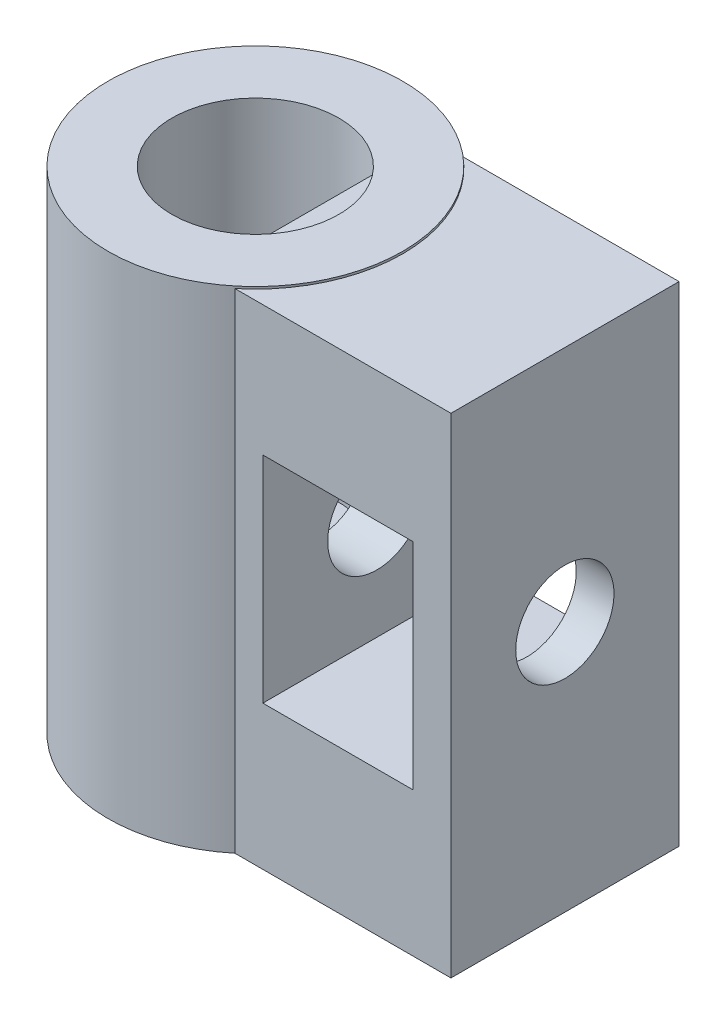
ISO-10303-21;
HEADER;
FILE_DESCRIPTION(('STEP AP214'),'2;1');
FILE_NAME('part.step','',(''),(''),'','','');
FILE_SCHEMA(('AUTOMOTIVE_DESIGN { 1 0 10303 214 1 1 1 1 }'));
ENDSEC;
DATA;
#1=APPLICATION_CONTEXT('core data for automotive mechanical design processes');
#2=APPLICATION_PROTOCOL_DEFINITION('international standard','automotive_design',2000,#1);
#3=PRODUCT_CONTEXT('',#1,'mechanical');
#4=PRODUCT('Part','Part','',(#3));
#5=PRODUCT_RELATED_PRODUCT_CATEGORY('part','',(#4));
#6=PRODUCT_DEFINITION_FORMATION('','',#4);
#7=PRODUCT_DEFINITION_CONTEXT('part definition',#1,'design');
#8=PRODUCT_DEFINITION('design','',#6,#7);
#9=PRODUCT_DEFINITION_SHAPE('','',#8);
#10=(LENGTH_UNIT() NAMED_UNIT(*) SI_UNIT(.MILLI.,.METRE.));
#11=(NAMED_UNIT(*) PLANE_ANGLE_UNIT() SI_UNIT($,.RADIAN.));
#12=(NAMED_UNIT(*) SI_UNIT($,.STERADIAN.) SOLID_ANGLE_UNIT());
#13=UNCERTAINTY_MEASURE_WITH_UNIT(LENGTH_MEASURE(1.E-05),#10,'distance_accuracy_value','');
#14=(GEOMETRIC_REPRESENTATION_CONTEXT(3) GLOBAL_UNCERTAINTY_ASSIGNED_CONTEXT((#13)) GLOBAL_UNIT_ASSIGNED_CONTEXT((#10,
#11,#12)) REPRESENTATION_CONTEXT('',''));
#15=CARTESIAN_POINT('',(0.,0.,0.));
#16=DIRECTION('',(0.,0.,1.));
#17=DIRECTION('',(1.,0.,0.));
#18=AXIS2_PLACEMENT_3D('',#15,#16,#17);
#19=CARTESIAN_POINT('',(12.6,19.9099600410235,-4.64846917483186));
#20=DIRECTION('',(0.,0.,-1.));
#21=DIRECTION('',(-1.,0.,0.));
#22=AXIS2_PLACEMENT_3D('',#19,#20,#21);
#23=PLANE('',#22);
#24=DIRECTION('',(0.,-1.,0.));
#25=VECTOR('',#24,1.);
#26=CARTESIAN_POINT('',(3.79364393830497,20.,-4.64846917483186));
#27=LINE('',#26,#25);
#28=CARTESIAN_POINT('',(3.79364393830497,19.9099600410235,-4.64846917483186));
#29=VERTEX_POINT('',#28);
#30=CARTESIAN_POINT('',(3.79364393830497,0.,-4.64846917483186));
#31=VERTEX_POINT('',#30);
#32=EDGE_CURVE('E170',#29,#31,#27,.T.);
#33=ORIENTED_EDGE('',*,*,#32,.F.);
#34=DIRECTION('',(-1.,0.,0.));
#35=VECTOR('',#34,1.);
#36=CARTESIAN_POINT('',(12.6,19.9099600410235,-4.64846917483186));
#37=LINE('',#36,#35);
#38=CARTESIAN_POINT('',(12.6,19.9099600410235,-4.64846917483186));
#39=VERTEX_POINT('',#38);
#40=EDGE_CURVE('E155',#39,#29,#37,.T.);
#41=ORIENTED_EDGE('',*,*,#40,.F.);
#42=DIRECTION('',(0.,-1.,0.));
#43=VECTOR('',#42,1.);
#44=CARTESIAN_POINT('',(12.6,19.9099600410235,-4.64846917483186));
#45=LINE('',#44,#43);
#46=CARTESIAN_POINT('',(12.6,0.,-4.64846917483186));
#47=VERTEX_POINT('',#46);
#48=EDGE_CURVE('E140',#39,#47,#45,.T.);
#49=ORIENTED_EDGE('',*,*,#48,.T.);
#50=DIRECTION('',(-1.,0.,0.));
#51=VECTOR('',#50,1.);
#52=CARTESIAN_POINT('',(12.6,0.,-4.64846917483186));
#53=LINE('',#52,#51);
#54=EDGE_CURVE('E152',#47,#31,#53,.T.);
#55=ORIENTED_EDGE('',*,*,#54,.T.);
#56=EDGE_LOOP('',(#33,#41,#49,#55));
#57=FACE_BOUND('',#56,.T.);
#58=DIRECTION('',(0.,1.,0.));
#59=VECTOR('',#58,1.);
#60=CARTESIAN_POINT('',(11.0634302269429,19.9099600410235,-4.64846917483186));
#61=LINE('',#60,#59);
#62=CARTESIAN_POINT('',(11.0634302269429,5.86192553685862,-4.64846917483186));
#63=VERTEX_POINT('',#62);
#64=CARTESIAN_POINT('',(11.0634302269429,14.6119255368586,-4.64846917483186));
#65=VERTEX_POINT('',#64);
#66=EDGE_CURVE('E109',#63,#65,#61,.T.);
#67=ORIENTED_EDGE('',*,*,#66,.T.);
#68=DIRECTION('',(-1.,0.,0.));
#69=VECTOR('',#68,1.);
#70=CARTESIAN_POINT('',(12.6,14.6119255368586,-4.64846917483186));
#71=LINE('',#70,#69);
#72=CARTESIAN_POINT('',(4.94343022694287,14.6119255368586,-4.64846917483186));
#73=VERTEX_POINT('',#72);
#74=EDGE_CURVE('E128',#65,#73,#71,.T.);
#75=ORIENTED_EDGE('',*,*,#74,.T.);
#76=DIRECTION('',(0.,-1.,0.));
#77=VECTOR('',#76,1.);
#78=CARTESIAN_POINT('',(4.94343022694287,19.9099600410235,-4.64846917483186));
#79=LINE('',#78,#77);
#80=CARTESIAN_POINT('',(4.94343022694287,5.86192553685862,-4.64846917483186));
#81=VERTEX_POINT('',#80);
#82=EDGE_CURVE('E127',#73,#81,#79,.T.);
#83=ORIENTED_EDGE('',*,*,#82,.T.);
#84=DIRECTION('',(1.,0.,0.));
#85=VECTOR('',#84,1.);
#86=CARTESIAN_POINT('',(12.6,5.86192553685862,-4.64846917483186));
#87=LINE('',#86,#85);
#88=EDGE_CURVE('E120',#81,#63,#87,.T.);
#89=ORIENTED_EDGE('',*,*,#88,.T.);
#90=EDGE_LOOP('',(#67,#75,#83,#89));
#91=FACE_BOUND('',#90,.T.);
#92=ADVANCED_FACE('F35',(#57,#91),#23,.T.);
#93=CARTESIAN_POINT('',(12.6,19.9099600410235,4.63803278086594));
#94=DIRECTION('',(0.,0.,1.));
#95=DIRECTION('',(0.,-1.,0.));
#96=AXIS2_PLACEMENT_3D('',#93,#94,#95);
#97=PLANE('',#96);
#98=DIRECTION('',(0.,-1.,0.));
#99=VECTOR('',#98,1.);
#100=CARTESIAN_POINT('',(3.80639618584468,20.,4.63803278086594));
#101=LINE('',#100,#99);
#102=CARTESIAN_POINT('',(3.80639618584468,0.,4.63803278086594));
#103=VERTEX_POINT('',#102);
#104=CARTESIAN_POINT('',(3.80639618584468,19.9099600410235,4.63803278086594));
#105=VERTEX_POINT('',#104);
#106=EDGE_CURVE('E168',#103,#105,#101,.F.);
#107=ORIENTED_EDGE('',*,*,#106,.F.);
#108=DIRECTION('',(-1.,0.,0.));
#109=VECTOR('',#108,1.);
#110=CARTESIAN_POINT('',(12.6,0.,4.63803278086594));
#111=LINE('',#110,#109);
#112=CARTESIAN_POINT('',(12.6,0.,4.63803278086594));
#113=VERTEX_POINT('',#112);
#114=EDGE_CURVE('E162',#113,#103,#111,.T.);
#115=ORIENTED_EDGE('',*,*,#114,.F.);
#116=DIRECTION('',(0.,1.,0.));
#117=VECTOR('',#116,1.);
#118=CARTESIAN_POINT('',(12.6,19.9099600410235,4.63803278086594));
#119=LINE('',#118,#117);
#120=CARTESIAN_POINT('',(12.6,19.9099600410235,4.63803278086594));
#121=VERTEX_POINT('',#120);
#122=EDGE_CURVE('E146',#113,#121,#119,.T.);
#123=ORIENTED_EDGE('',*,*,#122,.T.);
#124=DIRECTION('',(-1.,0.,0.));
#125=VECTOR('',#124,1.);
#126=CARTESIAN_POINT('',(12.6,19.9099600410235,4.63803278086594));
#127=LINE('',#126,#125);
#128=EDGE_CURVE('E159',#121,#105,#127,.T.);
#129=ORIENTED_EDGE('',*,*,#128,.T.);
#130=EDGE_LOOP('',(#107,#115,#123,#129));
#131=FACE_BOUND('',#130,.T.);
#132=DIRECTION('',(0.,1.,0.));
#133=VECTOR('',#132,1.);
#134=CARTESIAN_POINT('',(4.94343022694287,19.9099600410235,4.63803278086594));
#135=LINE('',#134,#133);
#136=CARTESIAN_POINT('',(4.94343022694287,5.86192553685862,4.63803278086594));
#137=VERTEX_POINT('',#136);
#138=CARTESIAN_POINT('',(4.94343022694287,14.6119255368586,4.63803278086594));
#139=VERTEX_POINT('',#138);
#140=EDGE_CURVE('E132',#137,#139,#135,.T.);
#141=ORIENTED_EDGE('',*,*,#140,.T.);
#142=DIRECTION('',(1.,0.,0.));
#143=VECTOR('',#142,1.);
#144=CARTESIAN_POINT('',(12.6,14.6119255368586,4.63803278086594));
#145=LINE('',#144,#143);
#146=CARTESIAN_POINT('',(11.0634302269429,14.6119255368586,4.63803278086594));
#147=VERTEX_POINT('',#146);
#148=EDGE_CURVE('E11',#139,#147,#145,.T.);
#149=ORIENTED_EDGE('',*,*,#148,.T.);
#150=DIRECTION('',(0.,-1.,0.));
#151=VECTOR('',#150,1.);
#152=CARTESIAN_POINT('',(11.0634302269429,19.9099600410235,4.63803278086594));
#153=LINE('',#152,#151);
#154=CARTESIAN_POINT('',(11.0634302269429,5.86192553685862,4.63803278086594));
#155=VERTEX_POINT('',#154);
#156=EDGE_CURVE('E115',#147,#155,#153,.T.);
#157=ORIENTED_EDGE('',*,*,#156,.T.);
#158=DIRECTION('',(-1.,0.,0.));
#159=VECTOR('',#158,1.);
#160=CARTESIAN_POINT('',(12.6,5.86192553685862,4.63803278086594));
#161=LINE('',#160,#159);
#162=EDGE_CURVE('E43',#155,#137,#161,.T.);
#163=ORIENTED_EDGE('',*,*,#162,.T.);
#164=EDGE_LOOP('',(#141,#149,#157,#163));
#165=FACE_BOUND('',#164,.T.);
#166=ADVANCED_FACE('F202',(#131,#165),#97,.T.);
#167=CARTESIAN_POINT('',(1.6,10.2369255368586,0.));
#168=DIRECTION('',(1.,0.,0.));
#169=DIRECTION('',(0.,0.,-1.));
#170=AXIS2_PLACEMENT_3D('',#167,#168,#169);
#171=CYLINDRICAL_SURFACE('',#170,2.);
#172=CARTESIAN_POINT('',(2.6,10.2369255368586,0.));
#173=DIRECTION('',(-1.,0.,0.));
#174=DIRECTION('',(0.,0.,1.));
#175=AXIS2_PLACEMENT_3D('',#172,#173,#174);
#176=CIRCLE('',#175,2.);
#177=CARTESIAN_POINT('',(2.6,10.2369255368586,2.));
#178=VERTEX_POINT('',#177);
#179=EDGE_CURVE('E136',#178,#178,#176,.F.);
#180=ORIENTED_EDGE('',*,*,#179,.F.);
#181=EDGE_LOOP('',(#180));
#182=FACE_BOUND('',#181,.T.);
#183=CARTESIAN_POINT('',(4.94343022694287,10.2369255368586,0.));
#184=DIRECTION('',(1.,0.,0.));
#185=DIRECTION('',(0.,0.,-1.));
#186=AXIS2_PLACEMENT_3D('',#183,#184,#185);
#187=CIRCLE('',#186,2.);
#188=CARTESIAN_POINT('',(4.94343022694287,10.2369255368586,-2.));
#189=VERTEX_POINT('',#188);
#190=EDGE_CURVE('E114',#189,#189,#187,.T.);
#191=ORIENTED_EDGE('',*,*,#190,.T.);
#192=EDGE_LOOP('',(#191));
#193=FACE_BOUND('',#192,.T.);
#194=ADVANCED_FACE('F233',(#182,#193),#171,.F.);
#195=CARTESIAN_POINT('',(12.6,10.2369255368586,0.));
#196=DIRECTION('',(-1.,0.,0.));
#197=DIRECTION('',(0.,0.,1.));
#198=AXIS2_PLACEMENT_3D('',#195,#196,#197);
#199=CIRCLE('',#198,2.);
#200=CARTESIAN_POINT('',(12.6,10.2369255368586,2.));
#201=VERTEX_POINT('',#200);
#202=EDGE_CURVE('E130',#201,#201,#199,.F.);
#203=ORIENTED_EDGE('',*,*,#202,.T.);
#204=EDGE_LOOP('',(#203));
#205=FACE_BOUND('',#204,.T.);
#206=CARTESIAN_POINT('',(11.0634302269429,10.2369255368586,0.));
#207=DIRECTION('',(-1.,0.,0.));
#208=DIRECTION('',(0.,0.,1.));
#209=AXIS2_PLACEMENT_3D('',#206,#207,#208);
#210=CIRCLE('',#209,2.);
#211=CARTESIAN_POINT('',(11.0634302269429,10.2369255368586,2.));
#212=VERTEX_POINT('',#211);
#213=EDGE_CURVE('E196',#212,#212,#210,.T.);
#214=ORIENTED_EDGE('',*,*,#213,.T.);
#215=EDGE_LOOP('',(#214));
#216=FACE_BOUND('',#215,.T.);
#217=ADVANCED_FACE('F275',(#205,#216),#171,.F.);
#218=CARTESIAN_POINT('',(0.,20.,0.));
#219=DIRECTION('',(0.,-1.,0.));
#220=DIRECTION('',(0.,0.,-1.));
#221=AXIS2_PLACEMENT_3D('',#218,#219,#220);
#222=CYLINDRICAL_SURFACE('',#221,6.);
#223=CARTESIAN_POINT('',(0.,20.,0.));
#224=DIRECTION('',(0.,1.,0.));
#225=DIRECTION('',(0.,0.,1.));
#226=AXIS2_PLACEMENT_3D('',#223,#224,#225);
#227=CIRCLE('',#226,6.);
#228=CARTESIAN_POINT('',(0.,20.,6.));
#229=VERTEX_POINT('',#228);
#230=EDGE_CURVE('E184',#229,#229,#227,.T.);
#231=ORIENTED_EDGE('',*,*,#230,.F.);
#232=EDGE_LOOP('',(#231));
#233=FACE_BOUND('',#232,.T.);
#234=CARTESIAN_POINT('',(0.,19.9099600410235,0.));
#235=DIRECTION('',(0.,1.,0.));
#236=DIRECTION('',(0.,0.,1.));
#237=AXIS2_PLACEMENT_3D('',#234,#235,#236);
#238=CIRCLE('',#237,6.);
#239=EDGE_CURVE('E158',#105,#29,#238,.T.);
#240=ORIENTED_EDGE('',*,*,#239,.T.);
#241=ORIENTED_EDGE('',*,*,#32,.T.);
#242=CARTESIAN_POINT('',(0.,0.,0.));
#243=DIRECTION('',(0.,1.,0.));
#244=DIRECTION('',(0.,0.,1.));
#245=AXIS2_PLACEMENT_3D('',#242,#243,#244);
#246=CIRCLE('',#245,6.);
#247=EDGE_CURVE('E181',#31,#103,#246,.T.);
#248=ORIENTED_EDGE('',*,*,#247,.T.);
#249=ORIENTED_EDGE('',*,*,#106,.T.);
#250=EDGE_LOOP('',(#240,#241,#248,#249));
#251=FACE_BOUND('',#250,.T.);
#252=ADVANCED_FACE('F37',(#233,#251),#222,.T.);
#253=CARTESIAN_POINT('',(0.,20.,0.));
#254=DIRECTION('',(0.,1.,0.));
#255=DIRECTION('',(0.,0.,1.));
#256=AXIS2_PLACEMENT_3D('',#253,#254,#255);
#257=PLANE('',#256);
#258=CARTESIAN_POINT('',(0.,20.,0.));
#259=DIRECTION('',(0.,1.,0.));
#260=DIRECTION('',(0.,0.,1.));
#261=AXIS2_PLACEMENT_3D('',#258,#259,#260);
#262=CIRCLE('',#261,3.4);
#263=CARTESIAN_POINT('',(0.,20.,3.4));
#264=VERTEX_POINT('',#263);
#265=EDGE_CURVE('E178',#264,#264,#262,.T.);
#266=ORIENTED_EDGE('',*,*,#265,.F.);
#267=EDGE_LOOP('',(#266));
#268=FACE_BOUND('',#267,.T.);
#269=ORIENTED_EDGE('',*,*,#230,.T.);
#270=EDGE_LOOP('',(#269));
#271=FACE_BOUND('',#270,.T.);
#272=ADVANCED_FACE('F253',(#268,#271),#257,.T.);
#273=CARTESIAN_POINT('',(0.,0.,0.));
#274=DIRECTION('',(0.,1.,0.));
#275=DIRECTION('',(0.,0.,1.));
#276=AXIS2_PLACEMENT_3D('',#273,#274,#275);
#277=PLANE('',#276);
#278=ORIENTED_EDGE('',*,*,#247,.F.);
#279=ORIENTED_EDGE('',*,*,#54,.F.);
#280=DIRECTION('',(0.,0.,1.));
#281=VECTOR('',#280,1.);
#282=CARTESIAN_POINT('',(12.6,0.,-4.64846917483186));
#283=LINE('',#282,#281);
#284=EDGE_CURVE('E143',#47,#113,#283,.T.);
#285=ORIENTED_EDGE('',*,*,#284,.T.);
#286=ORIENTED_EDGE('',*,*,#114,.T.);
#287=EDGE_LOOP('',(#278,#279,#285,#286));
#288=FACE_BOUND('',#287,.T.);
#289=ADVANCED_FACE('F251',(#288),#277,.F.);
#290=CARTESIAN_POINT('',(0.,6.45,0.));
#291=DIRECTION('',(0.,1.,0.));
#292=DIRECTION('',(0.,0.,1.));
#293=AXIS2_PLACEMENT_3D('',#290,#291,#292);
#294=CYLINDRICAL_SURFACE('',#293,3.4);
#295=CARTESIAN_POINT('',(0.,19.9099600410235,0.));
#296=DIRECTION('',(0.,1.,0.));
#297=DIRECTION('',(0.,0.,1.));
#298=AXIS2_PLACEMENT_3D('',#295,#296,#297);
#299=CIRCLE('',#298,3.4);
#300=CARTESIAN_POINT('',(2.6,19.9099600410235,-2.19089023002066));
#301=VERTEX_POINT('',#300);
#302=CARTESIAN_POINT('',(2.6,19.9099600410235,2.19089023002066));
#303=VERTEX_POINT('',#302);
#304=EDGE_CURVE('E191',#301,#303,#299,.F.);
#305=ORIENTED_EDGE('',*,*,#304,.T.);
#306=DIRECTION('',(0.,1.,0.));
#307=VECTOR('',#306,1.);
#308=CARTESIAN_POINT('',(2.6,6.45,2.19089023002067));
#309=LINE('',#308,#307);
#310=CARTESIAN_POINT('',(2.6,6.45,2.19089023002066));
#311=VERTEX_POINT('',#310);
#312=EDGE_CURVE('E175',#303,#311,#309,.F.);
#313=ORIENTED_EDGE('',*,*,#312,.T.);
#314=CARTESIAN_POINT('',(0.,6.45,0.));
#315=DIRECTION('',(0.,1.,0.));
#316=DIRECTION('',(0.,0.,1.));
#317=AXIS2_PLACEMENT_3D('',#314,#315,#316);
#318=CIRCLE('',#317,3.4);
#319=CARTESIAN_POINT('',(2.6,6.45,-2.19089023002066));
#320=VERTEX_POINT('',#319);
#321=EDGE_CURVE('E179',#320,#311,#318,.T.);
#322=ORIENTED_EDGE('',*,*,#321,.F.);
#323=DIRECTION('',(0.,1.,0.));
#324=VECTOR('',#323,1.);
#325=CARTESIAN_POINT('',(2.6,6.45,-2.19089023002067));
#326=LINE('',#325,#324);
#327=EDGE_CURVE('E173',#320,#301,#326,.T.);
#328=ORIENTED_EDGE('',*,*,#327,.T.);
#329=EDGE_LOOP('',(#305,#313,#322,#328));
#330=FACE_BOUND('',#329,.T.);
#331=ORIENTED_EDGE('',*,*,#265,.T.);
#332=EDGE_LOOP('',(#331));
#333=FACE_BOUND('',#332,.T.);
#334=ADVANCED_FACE('F247',(#330,#333),#294,.F.);
#335=CARTESIAN_POINT('',(0.,6.45,0.));
#336=DIRECTION('',(0.,1.,0.));
#337=DIRECTION('',(0.,0.,1.));
#338=AXIS2_PLACEMENT_3D('',#335,#336,#337);
#339=PLANE('',#338);
#340=DIRECTION('',(0.,0.,1.));
#341=VECTOR('',#340,1.);
#342=CARTESIAN_POINT('',(2.6,6.45,0.));
#343=LINE('',#342,#341);
#344=EDGE_CURVE('E187',#320,#311,#343,.T.);
#345=ORIENTED_EDGE('',*,*,#344,.F.);
#346=ORIENTED_EDGE('',*,*,#321,.T.);
#347=EDGE_LOOP('',(#345,#346));
#348=FACE_BOUND('',#347,.T.);
#349=ADVANCED_FACE('F243',(#348),#339,.T.);
#350=CARTESIAN_POINT('',(2.6,4.71,3.57158819939229));
#351=DIRECTION('',(-1.,0.,0.));
#352=DIRECTION('',(0.,0.,1.));
#353=AXIS2_PLACEMENT_3D('',#350,#351,#352);
#354=PLANE('',#353);
#355=ORIENTED_EDGE('',*,*,#179,.T.);
#356=EDGE_LOOP('',(#355));
#357=FACE_BOUND('',#356,.T.);
#358=ORIENTED_EDGE('',*,*,#312,.F.);
#359=DIRECTION('',(0.,0.,-1.));
#360=VECTOR('',#359,1.);
#361=CARTESIAN_POINT('',(2.6,19.9099600410235,-4.64846917483186));
#362=LINE('',#361,#360);
#363=EDGE_CURVE('E139',#303,#301,#362,.T.);
#364=ORIENTED_EDGE('',*,*,#363,.T.);
#365=ORIENTED_EDGE('',*,*,#327,.F.);
#366=ORIENTED_EDGE('',*,*,#344,.T.);
#367=EDGE_LOOP('',(#358,#364,#365,#366));
#368=FACE_BOUND('',#367,.T.);
#369=ADVANCED_FACE('F239',(#357,#368),#354,.T.);
#370=CARTESIAN_POINT('',(12.6,19.9099600410235,-4.64846917483186));
#371=DIRECTION('',(0.,1.,0.));
#372=DIRECTION('',(0.,0.,1.));
#373=AXIS2_PLACEMENT_3D('',#370,#371,#372);
#374=PLANE('',#373);
#375=ORIENTED_EDGE('',*,*,#304,.F.);
#376=ORIENTED_EDGE('',*,*,#363,.F.);
#377=EDGE_LOOP('',(#375,#376));
#378=FACE_BOUND('',#377,.T.);
#379=ADVANCED_FACE('F242',(#378),#374,.T.);
#380=ORIENTED_EDGE('',*,*,#239,.F.);
#381=ORIENTED_EDGE('',*,*,#128,.F.);
#382=DIRECTION('',(0.,0.,-1.));
#383=VECTOR('',#382,1.);
#384=CARTESIAN_POINT('',(12.6,19.9099600410235,-4.64846917483186));
#385=LINE('',#384,#383);
#386=EDGE_CURVE('E149',#121,#39,#385,.T.);
#387=ORIENTED_EDGE('',*,*,#386,.T.);
#388=ORIENTED_EDGE('',*,*,#40,.T.);
#389=EDGE_LOOP('',(#380,#381,#387,#388));
#390=FACE_BOUND('',#389,.T.);
#391=ADVANCED_FACE('F223',(#390),#374,.T.);
#392=CARTESIAN_POINT('',(12.6,0.,0.));
#393=DIRECTION('',(-1.,0.,0.));
#394=DIRECTION('',(0.,0.,1.));
#395=AXIS2_PLACEMENT_3D('',#392,#393,#394);
#396=PLANE('',#395);
#397=ORIENTED_EDGE('',*,*,#202,.F.);
#398=EDGE_LOOP('',(#397));
#399=FACE_BOUND('',#398,.T.);
#400=ORIENTED_EDGE('',*,*,#48,.F.);
#401=ORIENTED_EDGE('',*,*,#386,.F.);
#402=ORIENTED_EDGE('',*,*,#122,.F.);
#403=ORIENTED_EDGE('',*,*,#284,.F.);
#404=EDGE_LOOP('',(#400,#401,#402,#403));
#405=FACE_BOUND('',#404,.T.);
#406=ADVANCED_FACE('F215',(#399,#405),#396,.F.);
#407=CARTESIAN_POINT('',(4.94343022694287,14.6119255368586,10.));
#408=DIRECTION('',(0.,-1.,0.));
#409=DIRECTION('',(0.,0.,-1.));
#410=AXIS2_PLACEMENT_3D('',#407,#408,#409);
#411=PLANE('',#410);
#412=DIRECTION('',(0.,0.,-1.));
#413=VECTOR('',#412,1.);
#414=CARTESIAN_POINT('',(11.0634302269429,14.6119255368586,10.));
#415=LINE('',#414,#413);
#416=EDGE_CURVE('E50',#147,#65,#415,.T.);
#417=ORIENTED_EDGE('',*,*,#416,.F.);
#418=ORIENTED_EDGE('',*,*,#148,.F.);
#419=DIRECTION('',(0.,0.,-1.));
#420=VECTOR('',#419,1.);
#421=CARTESIAN_POINT('',(4.94343022694287,14.6119255368586,10.));
#422=LINE('',#421,#420);
#423=EDGE_CURVE('E206',#139,#73,#422,.T.);
#424=ORIENTED_EDGE('',*,*,#423,.T.);
#425=ORIENTED_EDGE('',*,*,#74,.F.);
#426=EDGE_LOOP('',(#417,#418,#424,#425));
#427=FACE_BOUND('',#426,.T.);
#428=ADVANCED_FACE('F213',(#427),#411,.T.);
#429=CARTESIAN_POINT('',(4.94343022694287,5.86192553685862,10.));
#430=DIRECTION('',(1.,0.,0.));
#431=DIRECTION('',(0.,0.,-1.));
#432=AXIS2_PLACEMENT_3D('',#429,#430,#431);
#433=PLANE('',#432);
#434=ORIENTED_EDGE('',*,*,#190,.F.);
#435=EDGE_LOOP('',(#434));
#436=FACE_BOUND('',#435,.T.);
#437=ORIENTED_EDGE('',*,*,#423,.F.);
#438=ORIENTED_EDGE('',*,*,#140,.F.);
#439=DIRECTION('',(0.,0.,-1.));
#440=VECTOR('',#439,1.);
#441=CARTESIAN_POINT('',(4.94343022694287,5.86192553685862,10.));
#442=LINE('',#441,#440);
#443=EDGE_CURVE('E124',#137,#81,#442,.T.);
#444=ORIENTED_EDGE('',*,*,#443,.T.);
#445=ORIENTED_EDGE('',*,*,#82,.F.);
#446=EDGE_LOOP('',(#437,#438,#444,#445));
#447=FACE_BOUND('',#446,.T.);
#448=ADVANCED_FACE('F211',(#436,#447),#433,.T.);
#449=CARTESIAN_POINT('',(4.94343022694287,5.86192553685862,10.));
#450=DIRECTION('',(0.,1.,0.));
#451=DIRECTION('',(0.,0.,1.));
#452=AXIS2_PLACEMENT_3D('',#449,#450,#451);
#453=PLANE('',#452);
#454=ORIENTED_EDGE('',*,*,#443,.F.);
#455=ORIENTED_EDGE('',*,*,#162,.F.);
#456=DIRECTION('',(0.,0.,-1.));
#457=VECTOR('',#456,1.);
#458=CARTESIAN_POINT('',(11.0634302269429,5.86192553685862,10.));
#459=LINE('',#458,#457);
#460=EDGE_CURVE('E55',#155,#63,#459,.T.);
#461=ORIENTED_EDGE('',*,*,#460,.T.);
#462=ORIENTED_EDGE('',*,*,#88,.F.);
#463=EDGE_LOOP('',(#454,#455,#461,#462));
#464=FACE_BOUND('',#463,.T.);
#465=ADVANCED_FACE('F119',(#464),#453,.T.);
#466=CARTESIAN_POINT('',(11.0634302269429,10.2369255368586,10.));
#467=DIRECTION('',(-1.,0.,0.));
#468=DIRECTION('',(0.,0.,1.));
#469=AXIS2_PLACEMENT_3D('',#466,#467,#468);
#470=PLANE('',#469);
#471=ORIENTED_EDGE('',*,*,#213,.F.);
#472=EDGE_LOOP('',(#471));
#473=FACE_BOUND('',#472,.T.);
#474=ORIENTED_EDGE('',*,*,#460,.F.);
#475=ORIENTED_EDGE('',*,*,#156,.F.);
#476=ORIENTED_EDGE('',*,*,#416,.T.);
#477=ORIENTED_EDGE('',*,*,#66,.F.);
#478=EDGE_LOOP('',(#474,#475,#476,#477));
#479=FACE_BOUND('',#478,.T.);
#480=ADVANCED_FACE('F110',(#473,#479),#470,.T.);
#481=CLOSED_SHELL('',(#92,#166,#194,#217,#252,#272,#289,#334,#349,#369,#379,#391,#406,#428,#448,
#465,#480));
#482=MANIFOLD_SOLID_BREP('B2',#481);
#483=ADVANCED_BREP_SHAPE_REPRESENTATION('',(#18,#482),#14);
#484=SHAPE_DEFINITION_REPRESENTATION(#9,#483);
ENDSEC;
END-ISO-10303-21;
